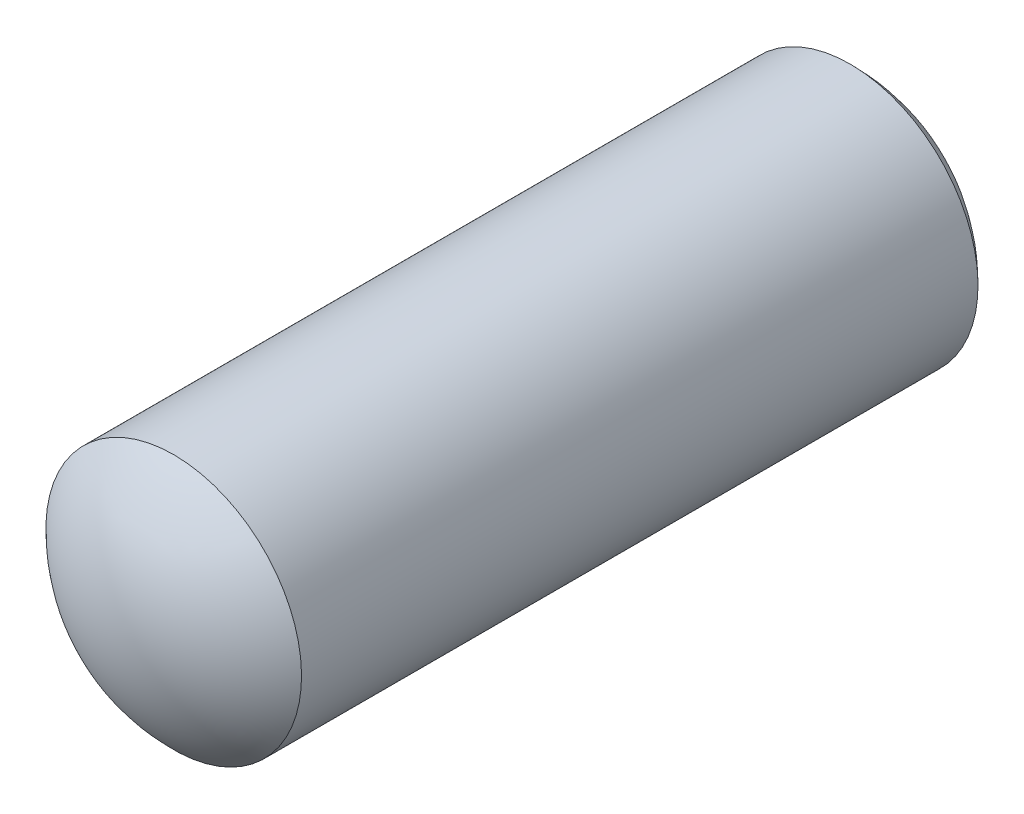
ISO-10303-21;
HEADER;
FILE_DESCRIPTION(('STEP AP214'),'2;1');
FILE_NAME('part.step','',(''),(''),'','','');
FILE_SCHEMA(('AUTOMOTIVE_DESIGN { 1 0 10303 214 1 1 1 1 }'));
ENDSEC;
DATA;
#1=APPLICATION_CONTEXT('core data for automotive mechanical design processes');
#2=APPLICATION_PROTOCOL_DEFINITION('international standard','automotive_design',2000,#1);
#3=PRODUCT_CONTEXT('',#1,'mechanical');
#4=PRODUCT('Part','Part','',(#3));
#5=PRODUCT_RELATED_PRODUCT_CATEGORY('part','',(#4));
#6=PRODUCT_DEFINITION_FORMATION('','',#4);
#7=PRODUCT_DEFINITION_CONTEXT('part definition',#1,'design');
#8=PRODUCT_DEFINITION('design','',#6,#7);
#9=PRODUCT_DEFINITION_SHAPE('','',#8);
#10=(LENGTH_UNIT() NAMED_UNIT(*) SI_UNIT(.MILLI.,.METRE.));
#11=(NAMED_UNIT(*) PLANE_ANGLE_UNIT() SI_UNIT($,.RADIAN.));
#12=(NAMED_UNIT(*) SI_UNIT($,.STERADIAN.) SOLID_ANGLE_UNIT());
#13=UNCERTAINTY_MEASURE_WITH_UNIT(LENGTH_MEASURE(1.E-05),#10,'distance_accuracy_value','');
#14=(GEOMETRIC_REPRESENTATION_CONTEXT(3) GLOBAL_UNCERTAINTY_ASSIGNED_CONTEXT((#13)) GLOBAL_UNIT_ASSIGNED_CONTEXT((#10,
#11,#12)) REPRESENTATION_CONTEXT('',''));
#15=CARTESIAN_POINT('',(0.,0.,0.));
#16=DIRECTION('',(0.,0.,1.));
#17=DIRECTION('',(1.,0.,0.));
#18=AXIS2_PLACEMENT_3D('',#15,#16,#17);
#19=CARTESIAN_POINT('',(-8.30039195760994,-3.79066199364219,7.875));
#20=DIRECTION('',(-0.415415013001886,0.909631995354519,0.));
#21=DIRECTION('',(0.,0.,1.));
#22=AXIS2_PLACEMENT_3D('',#19,#20,#21);
#23=SPHERICAL_SURFACE('',#22,1.575);
#24=CARTESIAN_POINT('',(-8.30039195760994,-3.79066199364219,7.875));
#25=DIRECTION('',(0.,0.,1.));
#26=DIRECTION('',(0.909631995354519,0.415415013001886,0.));
#27=AXIS2_PLACEMENT_3D('',#24,#25,#26);
#28=SPHERICAL_SURFACE('',#27,1.575);
#29=CARTESIAN_POINT('',(-8.30039195760994,-3.79066199364219,8.97727038425245));
#30=DIRECTION('',(0.,0.,1.));
#31=DIRECTION('',(0.909631995354519,0.415415013001886,0.));
#32=AXIS2_PLACEMENT_3D('',#29,#30,#31);
#33=CIRCLE('',#32,1.125);
#34=CARTESIAN_POINT('',(-7.27705596283611,-3.32332010401507,8.97727038425245));
#35=VERTEX_POINT('',#34);
#36=EDGE_CURVE('E11',#35,#35,#33,.T.);
#37=ORIENTED_EDGE('',*,*,#36,.T.);
#38=EDGE_LOOP('',(#37));
#39=FACE_BOUND('',#38,.T.);
#40=ADVANCED_FACE('F17',(#39),#28,.T.);
#41=CARTESIAN_POINT('',(-8.30039195760994,-3.79066199364219,6.));
#42=DIRECTION('',(0.,0.,1.));
#43=DIRECTION('',(0.909631995354519,0.415415013001886,0.));
#44=AXIS2_PLACEMENT_3D('',#41,#42,#43);
#45=CYLINDRICAL_SURFACE('',#44,1.125);
#46=CARTESIAN_POINT('',(-8.30039195760994,-3.79066199364219,3.02272961574759));
#47=DIRECTION('',(0.,0.,1.));
#48=DIRECTION('',(0.909631995354519,0.415415013001886,0.));
#49=AXIS2_PLACEMENT_3D('',#46,#47,#48);
#50=CIRCLE('',#49,1.125);
#51=CARTESIAN_POINT('',(-7.27705596283611,-3.32332010401507,3.02272961574759));
#52=VERTEX_POINT('',#51);
#53=EDGE_CURVE('E21',#52,#52,#50,.T.);
#54=ORIENTED_EDGE('',*,*,#53,.T.);
#55=EDGE_LOOP('',(#54));
#56=FACE_BOUND('',#55,.T.);
#57=ORIENTED_EDGE('',*,*,#36,.F.);
#58=EDGE_LOOP('',(#57));
#59=FACE_BOUND('',#58,.T.);
#60=ADVANCED_FACE('F19',(#56,#59),#45,.T.);
#61=CARTESIAN_POINT('',(-8.30039195760994,-3.79066199364219,4.125));
#62=DIRECTION('',(-0.415415013001886,0.909631995354519,0.));
#63=DIRECTION('',(0.,0.,-1.));
#64=AXIS2_PLACEMENT_3D('',#61,#62,#63);
#65=SPHERICAL_SURFACE('',#64,1.575);
#66=CARTESIAN_POINT('',(-8.30039195760994,-3.79066199364219,4.125));
#67=DIRECTION('',(0.,0.,1.));
#68=DIRECTION('',(0.909631995354519,0.415415013001886,0.));
#69=AXIS2_PLACEMENT_3D('',#66,#67,#68);
#70=SPHERICAL_SURFACE('',#69,1.575);
#71=ORIENTED_EDGE('',*,*,#53,.F.);
#72=EDGE_LOOP('',(#71));
#73=FACE_BOUND('',#72,.T.);
#74=ADVANCED_FACE('F57',(#73),#70,.T.);
#75=CLOSED_SHELL('',(#40,#60,#74));
#76=MANIFOLD_SOLID_BREP('B1',#75);
#77=ADVANCED_BREP_SHAPE_REPRESENTATION('',(#18,#76),#14);
#78=SHAPE_DEFINITION_REPRESENTATION(#9,#77);
ENDSEC;
END-ISO-10303-21;
